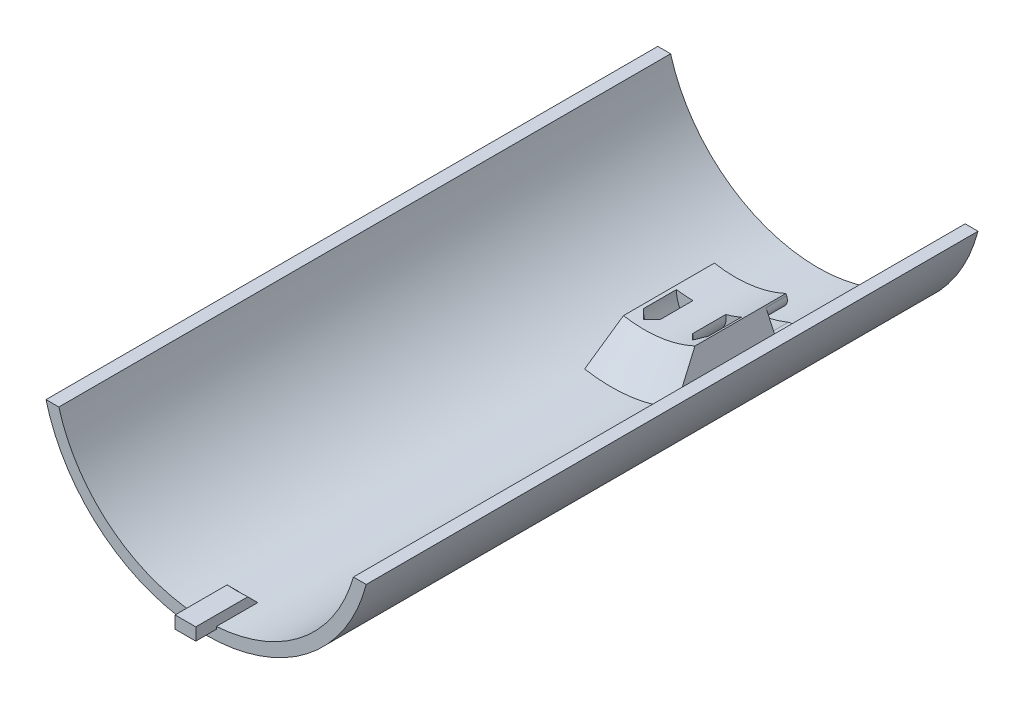
ISO-10303-21;
HEADER;
FILE_DESCRIPTION(('STEP AP214'),'2;1');
FILE_NAME('part.step','',(''),(''),'','','');
FILE_SCHEMA(('AUTOMOTIVE_DESIGN { 1 0 10303 214 1 1 1 1 }'));
ENDSEC;
DATA;
#1=APPLICATION_CONTEXT('core data for automotive mechanical design processes');
#2=APPLICATION_PROTOCOL_DEFINITION('international standard','automotive_design',2000,#1);
#3=PRODUCT_CONTEXT('',#1,'mechanical');
#4=PRODUCT('Part','Part','',(#3));
#5=PRODUCT_RELATED_PRODUCT_CATEGORY('part','',(#4));
#6=PRODUCT_DEFINITION_FORMATION('','',#4);
#7=PRODUCT_DEFINITION_CONTEXT('part definition',#1,'design');
#8=PRODUCT_DEFINITION('design','',#6,#7);
#9=PRODUCT_DEFINITION_SHAPE('','',#8);
#10=(LENGTH_UNIT() NAMED_UNIT(*) SI_UNIT(.MILLI.,.METRE.));
#11=(NAMED_UNIT(*) PLANE_ANGLE_UNIT() SI_UNIT($,.RADIAN.));
#12=(NAMED_UNIT(*) SI_UNIT($,.STERADIAN.) SOLID_ANGLE_UNIT());
#13=UNCERTAINTY_MEASURE_WITH_UNIT(LENGTH_MEASURE(1.E-05),#10,'distance_accuracy_value','');
#14=(GEOMETRIC_REPRESENTATION_CONTEXT(3) GLOBAL_UNCERTAINTY_ASSIGNED_CONTEXT((#13)) GLOBAL_UNIT_ASSIGNED_CONTEXT((#10,
#11,#12)) REPRESENTATION_CONTEXT('',''));
#15=CARTESIAN_POINT('',(0.,0.,0.));
#16=DIRECTION('',(0.,0.,1.));
#17=DIRECTION('',(1.,0.,0.));
#18=AXIS2_PLACEMENT_3D('',#15,#16,#17);
#19=CARTESIAN_POINT('',(0.,0.,40.));
#20=DIRECTION('',(0.90630778703665,0.4226182617407,0.));
#21=DIRECTION('',(-0.4226182617407,0.90630778703665,0.));
#22=AXIS2_PLACEMENT_3D('',#19,#20,#21);
#23=PLANE('',#22);
#24=DIRECTION('',(0.4226182617407,-0.90630778703665,0.));
#25=VECTOR('',#24,1.);
#26=CARTESIAN_POINT('',(0.,0.,20.));
#27=LINE('',#26,#25);
#28=CARTESIAN_POINT('',(15.4023919803688,-33.0305361943017,20.));
#29=VERTEX_POINT('',#28);
#30=CARTESIAN_POINT('',(15.6368756844059,-33.533388120356,20.));
#31=VERTEX_POINT('',#30);
#32=EDGE_CURVE('E258',#29,#31,#27,.T.);
#33=ORIENTED_EDGE('',*,*,#32,.F.);
#34=DIRECTION('',(0.,0.,-1.));
#35=VECTOR('',#34,1.);
#36=CARTESIAN_POINT('',(15.4023919803688,-33.0305361943017,40.));
#37=LINE('',#36,#35);
#38=CARTESIAN_POINT('',(15.4023919803688,-33.0305361943017,25.));
#39=VERTEX_POINT('',#38);
#40=EDGE_CURVE('E693',#29,#39,#37,.F.);
#41=ORIENTED_EDGE('',*,*,#40,.T.);
#42=DIRECTION('',(0.4226182617407,-0.90630778703665,0.));
#43=VECTOR('',#42,1.);
#44=CARTESIAN_POINT('',(0.,0.,25.));
#45=LINE('',#44,#43);
#46=CARTESIAN_POINT('',(12.4385536359546,-26.6745643534338,25.));
#47=VERTEX_POINT('',#46);
#48=EDGE_CURVE('E246',#47,#39,#45,.T.);
#49=ORIENTED_EDGE('',*,*,#48,.F.);
#50=DIRECTION('',(0.,0.,1.));
#51=VECTOR('',#50,1.);
#52=CARTESIAN_POINT('',(12.4385536359546,-26.6745643534338,20.));
#53=LINE('',#52,#51);
#54=CARTESIAN_POINT('',(12.4385536359546,-26.6745643534338,20.));
#55=VERTEX_POINT('',#54);
#56=EDGE_CURVE('E696',#47,#55,#53,.F.);
#57=ORIENTED_EDGE('',*,*,#56,.T.);
#58=CARTESIAN_POINT('',(12.2559295904803,-26.2829258240628,20.));
#59=VERTEX_POINT('',#58);
#60=EDGE_CURVE('E261',#59,#55,#27,.T.);
#61=ORIENTED_EDGE('',*,*,#60,.F.);
#62=DIRECTION('',(0.,0.,-1.));
#63=VECTOR('',#62,1.);
#64=CARTESIAN_POINT('',(12.2559295904803,-26.2829258240628,40.));
#65=LINE('',#64,#63);
#66=CARTESIAN_POINT('',(12.2559295904803,-26.2829258240628,42.0000000000001));
#67=VERTEX_POINT('',#66);
#68=EDGE_CURVE('E274',#67,#59,#65,.T.);
#69=ORIENTED_EDGE('',*,*,#68,.F.);
#70=DIRECTION('',(-0.298836238730119,0.640856382055785,-0.707106781186551));
#71=VECTOR('',#70,1.);
#72=CARTESIAN_POINT('',(0.,0.,12.9999999999998));
#73=LINE('',#72,#71);
#74=CARTESIAN_POINT('',(15.6368756844059,-33.533388120356,50.0000000000002));
#75=VERTEX_POINT('',#74);
#76=EDGE_CURVE('E706',#67,#75,#73,.F.);
#77=ORIENTED_EDGE('',*,*,#76,.T.);
#78=DIRECTION('',(0.,0.,-1.));
#79=VECTOR('',#78,1.);
#80=CARTESIAN_POINT('',(15.6368756844059,-33.533388120356,40.));
#81=LINE('',#80,#79);
#82=EDGE_CURVE('E273',#75,#31,#81,.T.);
#83=ORIENTED_EDGE('',*,*,#82,.T.);
#84=EDGE_LOOP('',(#33,#41,#49,#57,#61,#69,#77,#83));
#85=FACE_BOUND('',#84,.T.);
#86=ADVANCED_FACE('F37',(#85),#23,.T.);
#87=CARTESIAN_POINT('',(0.,0.,20.));
#88=DIRECTION('',(0.,0.,-1.));
#89=DIRECTION('',(-1.,0.,0.));
#90=AXIS2_PLACEMENT_3D('',#87,#88,#89);
#91=PLANE('',#90);
#92=CARTESIAN_POINT('',(0.,0.,20.));
#93=DIRECTION('',(0.,0.,-1.));
#94=DIRECTION('',(-1.,0.,0.));
#95=AXIS2_PLACEMENT_3D('',#92,#93,#94);
#96=CIRCLE('',#95,34.5);
#97=CARTESIAN_POINT('',(0.,-34.5,20.));
#98=VERTEX_POINT('',#97);
#99=CARTESIAN_POINT('',(12.8451311237587,-32.019565993521,20.));
#100=VERTEX_POINT('',#99);
#101=EDGE_CURVE('E232',#98,#100,#96,.F.);
#102=ORIENTED_EDGE('',*,*,#101,.T.);
#103=CARTESIAN_POINT('',(13.5897764062955,-33.8757727177831,20.));
#104=DIRECTION('',(0.,0.,-1.));
#105=DIRECTION('',(-1.,0.,0.));
#106=AXIS2_PLACEMENT_3D('',#103,#104,#105);
#107=CIRCLE('',#106,2.);
#108=EDGE_CURVE('E699',#100,#29,#107,.T.);
#109=ORIENTED_EDGE('',*,*,#108,.T.);
#110=ORIENTED_EDGE('',*,*,#32,.T.);
#111=CARTESIAN_POINT('',(0.,0.,20.));
#112=DIRECTION('',(0.,0.,-1.));
#113=DIRECTION('',(-1.,0.,0.));
#114=AXIS2_PLACEMENT_3D('',#111,#112,#113);
#115=CIRCLE('',#114,37.);
#116=CARTESIAN_POINT('',(-6.42498257367619,-36.4378868614517,20.));
#117=VERTEX_POINT('',#116);
#118=EDGE_CURVE('E264',#31,#117,#115,.T.);
#119=ORIENTED_EDGE('',*,*,#118,.T.);
#120=DIRECTION('',(0.173648177666924,0.984807753012209,0.));
#121=VECTOR('',#120,1.);
#122=CARTESIAN_POINT('',(0.,0.,20.));
#123=LINE('',#122,#121);
#124=CARTESIAN_POINT('',(-5.03579715234079,-28.5594248373541,20.));
#125=VERTEX_POINT('',#124);
#126=EDGE_CURVE('E267',#117,#125,#123,.T.);
#127=ORIENTED_EDGE('',*,*,#126,.T.);
#128=CARTESIAN_POINT('',(0.,0.,20.));
#129=DIRECTION('',(0.,0.,-1.));
#130=DIRECTION('',(-1.,0.,0.));
#131=AXIS2_PLACEMENT_3D('',#128,#129,#130);
#132=CIRCLE('',#131,29.);
#133=EDGE_CURVE('E270',#59,#125,#132,.T.);
#134=ORIENTED_EDGE('',*,*,#133,.F.);
#135=ORIENTED_EDGE('',*,*,#60,.T.);
#136=CARTESIAN_POINT('',(10.6259380618813,-27.5198008769152,20.));
#137=DIRECTION('',(0.,0.,-1.));
#138=DIRECTION('',(-1.,0.,0.));
#139=AXIS2_PLACEMENT_3D('',#136,#137,#138);
#140=CIRCLE('',#139,2.);
#141=CARTESIAN_POINT('',(11.3463406423478,-29.3855500889095,20.));
#142=VERTEX_POINT('',#141);
#143=EDGE_CURVE('E701',#55,#142,#140,.T.);
#144=ORIENTED_EDGE('',*,*,#143,.T.);
#145=CARTESIAN_POINT('',(0.,0.,20.));
#146=DIRECTION('',(0.,0.,-1.));
#147=DIRECTION('',(-1.,0.,0.));
#148=AXIS2_PLACEMENT_3D('',#145,#146,#147);
#149=CIRCLE('',#148,31.5);
#150=CARTESIAN_POINT('',(0.,-31.5,20.));
#151=VERTEX_POINT('',#150);
#152=EDGE_CURVE('E240',#151,#142,#149,.F.);
#153=ORIENTED_EDGE('',*,*,#152,.F.);
#154=CARTESIAN_POINT('',(0.,-33.,20.));
#155=DIRECTION('',(0.,0.,-1.));
#156=DIRECTION('',(-1.,0.,0.));
#157=AXIS2_PLACEMENT_3D('',#154,#155,#156);
#158=CIRCLE('',#157,1.5);
#159=EDGE_CURVE('E251',#98,#151,#158,.T.);
#160=ORIENTED_EDGE('',*,*,#159,.F.);
#161=EDGE_LOOP('',(#102,#109,#110,#119,#127,#134,#135,#144,#153,#160));
#162=FACE_BOUND('',#161,.T.);
#163=ADVANCED_FACE('F421',(#162),#91,.T.);
#164=CARTESIAN_POINT('',(0.,0.,148.));
#165=DIRECTION('',(0.,0.,-1.));
#166=DIRECTION('',(-1.,0.,0.));
#167=AXIS2_PLACEMENT_3D('',#164,#165,#166);
#168=CYLINDRICAL_SURFACE('',#167,37.);
#169=CARTESIAN_POINT('',(0.,0.,138.));
#170=DIRECTION('',(0.,0.,1.));
#171=DIRECTION('',(1.,0.,0.));
#172=AXIS2_PLACEMENT_3D('',#169,#170,#171);
#173=CIRCLE('',#172,37.);
#174=CARTESIAN_POINT('',(-2.5,-36.9154439225644,138.));
#175=VERTEX_POINT('',#174);
#176=CARTESIAN_POINT('',(2.5,-36.9154439225644,138.));
#177=VERTEX_POINT('',#176);
#178=EDGE_CURVE('E344',#175,#177,#173,.T.);
#179=ORIENTED_EDGE('',*,*,#178,.T.);
#180=DIRECTION('',(0.,0.,-1.));
#181=VECTOR('',#180,1.);
#182=CARTESIAN_POINT('',(2.5,-36.9154439225644,138.));
#183=LINE('',#182,#181);
#184=CARTESIAN_POINT('',(2.5,-36.9154439225644,148.));
#185=VERTEX_POINT('',#184);
#186=EDGE_CURVE('E347',#177,#185,#183,.F.);
#187=ORIENTED_EDGE('',*,*,#186,.T.);
#188=CARTESIAN_POINT('',(0.,0.,148.));
#189=DIRECTION('',(0.,0.,1.));
#190=DIRECTION('',(1.,0.,0.));
#191=AXIS2_PLACEMENT_3D('',#188,#189,#190);
#192=CIRCLE('',#191,37.);
#193=CARTESIAN_POINT('',(35.6230262611138,-10.,148.));
#194=VERTEX_POINT('',#193);
#195=EDGE_CURVE('E315',#185,#194,#192,.T.);
#196=ORIENTED_EDGE('',*,*,#195,.T.);
#197=DIRECTION('',(0.,0.,-1.));
#198=VECTOR('',#197,1.);
#199=CARTESIAN_POINT('',(35.6230262611138,-10.,148.));
#200=LINE('',#199,#198);
#201=CARTESIAN_POINT('',(35.6230262611138,-10.,0.));
#202=VERTEX_POINT('',#201);
#203=EDGE_CURVE('E322',#194,#202,#200,.T.);
#204=ORIENTED_EDGE('',*,*,#203,.T.);
#205=CARTESIAN_POINT('',(0.,0.,0.));
#206=DIRECTION('',(0.,0.,1.));
#207=DIRECTION('',(1.,0.,0.));
#208=AXIS2_PLACEMENT_3D('',#205,#206,#207);
#209=CIRCLE('',#208,37.);
#210=CARTESIAN_POINT('',(-35.6230262611138,-10.,0.));
#211=VERTEX_POINT('',#210);
#212=EDGE_CURVE('E310',#211,#202,#209,.T.);
#213=ORIENTED_EDGE('',*,*,#212,.F.);
#214=DIRECTION('',(0.,0.,-1.));
#215=VECTOR('',#214,1.);
#216=CARTESIAN_POINT('',(-35.6230262611138,-10.,148.));
#217=LINE('',#216,#215);
#218=CARTESIAN_POINT('',(-35.6230262611138,-10.,148.));
#219=VERTEX_POINT('',#218);
#220=EDGE_CURVE('E339',#219,#211,#217,.T.);
#221=ORIENTED_EDGE('',*,*,#220,.F.);
#222=CARTESIAN_POINT('',(-2.5,-36.9154439225644,148.));
#223=VERTEX_POINT('',#222);
#224=EDGE_CURVE('E311',#219,#223,#192,.T.);
#225=ORIENTED_EDGE('',*,*,#224,.T.);
#226=DIRECTION('',(0.,0.,-1.));
#227=VECTOR('',#226,1.);
#228=CARTESIAN_POINT('',(-2.5,-36.9154439225644,148.));
#229=LINE('',#228,#227);
#230=EDGE_CURVE('E341',#223,#175,#229,.T.);
#231=ORIENTED_EDGE('',*,*,#230,.T.);
#232=EDGE_LOOP('',(#179,#187,#196,#204,#213,#221,#225,#231));
#233=FACE_BOUND('',#232,.T.);
#234=CARTESIAN_POINT('',(0.,0.,50.0000000000002));
#235=DIRECTION('',(0.,0.,-1.));
#236=DIRECTION('',(-1.,0.,0.));
#237=AXIS2_PLACEMENT_3D('',#234,#235,#236);
#238=CIRCLE('',#237,37.);
#239=CARTESIAN_POINT('',(-6.42498257367619,-36.4378868614517,50.0000000000002));
#240=VERTEX_POINT('',#239);
#241=EDGE_CURVE('E392',#75,#240,#238,.T.);
#242=ORIENTED_EDGE('',*,*,#241,.T.);
#243=DIRECTION('',(0.,0.,-1.));
#244=VECTOR('',#243,1.);
#245=CARTESIAN_POINT('',(-6.42498257367619,-36.4378868614517,40.));
#246=LINE('',#245,#244);
#247=EDGE_CURVE('E279',#240,#117,#246,.T.);
#248=ORIENTED_EDGE('',*,*,#247,.T.);
#249=ORIENTED_EDGE('',*,*,#118,.F.);
#250=ORIENTED_EDGE('',*,*,#82,.F.);
#251=EDGE_LOOP('',(#242,#248,#249,#250));
#252=FACE_BOUND('',#251,.T.);
#253=ADVANCED_FACE('F379',(#233,#252),#168,.F.);
#254=CARTESIAN_POINT('',(0.,0.,148.));
#255=DIRECTION('',(0.,0.,1.));
#256=DIRECTION('',(1.,0.,0.));
#257=AXIS2_PLACEMENT_3D('',#254,#255,#256);
#258=PLANE('',#257);
#259=DIRECTION('',(-1.,0.,0.));
#260=VECTOR('',#259,1.);
#261=CARTESIAN_POINT('',(0.,-37.5,148.));
#262=LINE('',#261,#260);
#263=CARTESIAN_POINT('',(2.5,-37.5,148.));
#264=VERTEX_POINT('',#263);
#265=CARTESIAN_POINT('',(-2.5,-37.5,148.));
#266=VERTEX_POINT('',#265);
#267=EDGE_CURVE('E297',#264,#266,#262,.T.);
#268=ORIENTED_EDGE('',*,*,#267,.T.);
#269=DIRECTION('',(0.,1.,0.));
#270=VECTOR('',#269,1.);
#271=CARTESIAN_POINT('',(-2.5,0.,148.));
#272=LINE('',#271,#270);
#273=EDGE_CURVE('E276',#266,#223,#272,.T.);
#274=ORIENTED_EDGE('',*,*,#273,.T.);
#275=ORIENTED_EDGE('',*,*,#224,.F.);
#276=DIRECTION('',(-1.,0.,0.));
#277=VECTOR('',#276,1.);
#278=CARTESIAN_POINT('',(0.,-10.,148.));
#279=LINE('',#278,#277);
#280=CARTESIAN_POINT('',(-38.7298334620742,-10.,148.));
#281=VERTEX_POINT('',#280);
#282=EDGE_CURVE('E314',#219,#281,#279,.T.);
#283=ORIENTED_EDGE('',*,*,#282,.T.);
#284=CARTESIAN_POINT('',(0.,0.,148.));
#285=DIRECTION('',(0.,0.,1.));
#286=DIRECTION('',(1.,0.,0.));
#287=AXIS2_PLACEMENT_3D('',#284,#285,#286);
#288=CIRCLE('',#287,40.);
#289=CARTESIAN_POINT('',(38.7298334620742,-10.,148.));
#290=VERTEX_POINT('',#289);
#291=EDGE_CURVE('E317',#281,#290,#288,.T.);
#292=ORIENTED_EDGE('',*,*,#291,.T.);
#293=DIRECTION('',(-1.,0.,0.));
#294=VECTOR('',#293,1.);
#295=CARTESIAN_POINT('',(0.,-10.,148.));
#296=LINE('',#295,#294);
#297=EDGE_CURVE('E319',#290,#194,#296,.T.);
#298=ORIENTED_EDGE('',*,*,#297,.T.);
#299=ORIENTED_EDGE('',*,*,#195,.F.);
#300=DIRECTION('',(0.,1.,0.));
#301=VECTOR('',#300,1.);
#302=CARTESIAN_POINT('',(2.5,0.,148.));
#303=LINE('',#302,#301);
#304=EDGE_CURVE('E287',#264,#185,#303,.T.);
#305=ORIENTED_EDGE('',*,*,#304,.F.);
#306=EDGE_LOOP('',(#268,#274,#275,#283,#292,#298,#299,#305));
#307=FACE_BOUND('',#306,.T.);
#308=ADVANCED_FACE('F401',(#307),#258,.T.);
#309=CARTESIAN_POINT('',(0.,-10.,148.));
#310=DIRECTION('',(0.,-1.,0.));
#311=DIRECTION('',(0.,0.,-1.));
#312=AXIS2_PLACEMENT_3D('',#309,#310,#311);
#313=PLANE('',#312);
#314=DIRECTION('',(-1.,0.,0.));
#315=VECTOR('',#314,1.);
#316=CARTESIAN_POINT('',(0.,-10.,0.));
#317=LINE('',#316,#315);
#318=CARTESIAN_POINT('',(-38.7298334620742,-10.,0.));
#319=VERTEX_POINT('',#318);
#320=EDGE_CURVE('E325',#211,#319,#317,.T.);
#321=ORIENTED_EDGE('',*,*,#320,.T.);
#322=DIRECTION('',(0.,0.,-1.));
#323=VECTOR('',#322,1.);
#324=CARTESIAN_POINT('',(-38.7298334620742,-10.,148.));
#325=LINE('',#324,#323);
#326=EDGE_CURVE('E336',#281,#319,#325,.T.);
#327=ORIENTED_EDGE('',*,*,#326,.F.);
#328=ORIENTED_EDGE('',*,*,#282,.F.);
#329=ORIENTED_EDGE('',*,*,#220,.T.);
#330=EDGE_LOOP('',(#321,#327,#328,#329));
#331=FACE_BOUND('',#330,.T.);
#332=ADVANCED_FACE('F404',(#331),#313,.F.);
#333=CARTESIAN_POINT('',(0.,0.,148.));
#334=DIRECTION('',(0.,0.,-1.));
#335=DIRECTION('',(-1.,0.,0.));
#336=AXIS2_PLACEMENT_3D('',#333,#334,#335);
#337=CYLINDRICAL_SURFACE('',#336,40.);
#338=CARTESIAN_POINT('',(0.,0.,0.));
#339=DIRECTION('',(0.,0.,1.));
#340=DIRECTION('',(1.,0.,0.));
#341=AXIS2_PLACEMENT_3D('',#338,#339,#340);
#342=CIRCLE('',#341,40.);
#343=CARTESIAN_POINT('',(38.7298334620742,-10.,0.));
#344=VERTEX_POINT('',#343);
#345=EDGE_CURVE('E327',#319,#344,#342,.T.);
#346=ORIENTED_EDGE('',*,*,#345,.T.);
#347=DIRECTION('',(0.,0.,-1.));
#348=VECTOR('',#347,1.);
#349=CARTESIAN_POINT('',(38.7298334620742,-10.,148.));
#350=LINE('',#349,#348);
#351=EDGE_CURVE('E333',#290,#344,#350,.T.);
#352=ORIENTED_EDGE('',*,*,#351,.F.);
#353=ORIENTED_EDGE('',*,*,#291,.F.);
#354=ORIENTED_EDGE('',*,*,#326,.T.);
#355=EDGE_LOOP('',(#346,#352,#353,#354));
#356=FACE_BOUND('',#355,.T.);
#357=ADVANCED_FACE('F412',(#356),#337,.T.);
#358=CARTESIAN_POINT('',(0.,-10.,148.));
#359=DIRECTION('',(0.,-1.,0.));
#360=DIRECTION('',(0.,0.,-1.));
#361=AXIS2_PLACEMENT_3D('',#358,#359,#360);
#362=PLANE('',#361);
#363=DIRECTION('',(-1.,0.,0.));
#364=VECTOR('',#363,1.);
#365=CARTESIAN_POINT('',(0.,-10.,0.));
#366=LINE('',#365,#364);
#367=EDGE_CURVE('E329',#344,#202,#366,.T.);
#368=ORIENTED_EDGE('',*,*,#367,.T.);
#369=ORIENTED_EDGE('',*,*,#203,.F.);
#370=ORIENTED_EDGE('',*,*,#297,.F.);
#371=ORIENTED_EDGE('',*,*,#351,.T.);
#372=EDGE_LOOP('',(#368,#369,#370,#371));
#373=FACE_BOUND('',#372,.T.);
#374=ADVANCED_FACE('F408',(#373),#362,.F.);
#375=CARTESIAN_POINT('',(0.,0.,0.));
#376=DIRECTION('',(0.,0.,1.));
#377=DIRECTION('',(1.,0.,0.));
#378=AXIS2_PLACEMENT_3D('',#375,#376,#377);
#379=PLANE('',#378);
#380=ORIENTED_EDGE('',*,*,#212,.T.);
#381=ORIENTED_EDGE('',*,*,#367,.F.);
#382=ORIENTED_EDGE('',*,*,#345,.F.);
#383=ORIENTED_EDGE('',*,*,#320,.F.);
#384=EDGE_LOOP('',(#380,#381,#382,#383));
#385=FACE_BOUND('',#384,.T.);
#386=ADVANCED_FACE('F399',(#385),#379,.F.);
#387=CARTESIAN_POINT('',(-2.5,0.,153.));
#388=DIRECTION('',(-1.,0.,0.));
#389=DIRECTION('',(0.,0.,1.));
#390=AXIS2_PLACEMENT_3D('',#387,#388,#389);
#391=PLANE('',#390);
#392=ORIENTED_EDGE('',*,*,#273,.F.);
#393=DIRECTION('',(0.,0.,-1.));
#394=VECTOR('',#393,1.);
#395=CARTESIAN_POINT('',(-2.5,-37.5,153.));
#396=LINE('',#395,#394);
#397=CARTESIAN_POINT('',(-2.5,-37.5,153.));
#398=VERTEX_POINT('',#397);
#399=EDGE_CURVE('E307',#398,#266,#396,.T.);
#400=ORIENTED_EDGE('',*,*,#399,.F.);
#401=DIRECTION('',(0.,1.,0.));
#402=VECTOR('',#401,1.);
#403=CARTESIAN_POINT('',(-2.5,0.,153.));
#404=LINE('',#403,#402);
#405=CARTESIAN_POINT('',(-2.5,-34.5,153.));
#406=VERTEX_POINT('',#405);
#407=EDGE_CURVE('E283',#398,#406,#404,.T.);
#408=ORIENTED_EDGE('',*,*,#407,.T.);
#409=DIRECTION('',(0.,0.,-1.));
#410=VECTOR('',#409,1.);
#411=CARTESIAN_POINT('',(-2.5,-34.5,153.));
#412=LINE('',#411,#410);
#413=CARTESIAN_POINT('',(-2.5,-34.5,140.409538887144));
#414=VERTEX_POINT('',#413);
#415=EDGE_CURVE('E294',#406,#414,#412,.T.);
#416=ORIENTED_EDGE('',*,*,#415,.T.);
#417=CARTESIAN_POINT('',(-2.5,-34.5,140.409538887144));
#418=CARTESIAN_POINT('',(-2.5,-34.9026071521608,140.007982318918));
#419=CARTESIAN_POINT('',(-2.5,-35.3051977217997,139.606409127531));
#420=CARTESIAN_POINT('',(-2.5,-36.1103456959879,138.803229498483));
#421=CARTESIAN_POINT('',(-2.5,-36.512903100537,138.401623060822));
#422=CARTESIAN_POINT('',(-2.5,-36.9154439225644,138.));
#423=B_SPLINE_CURVE_WITH_KNOTS('',3,(#417,#418,#419,#420,#421,#422),.UNSPECIFIED.,.F.,.F.,(4,2,
4),(0.,1.70589031101767,3.41178062183955),.UNSPECIFIED.);
#424=EDGE_CURVE('E385',#414,#175,#423,.T.);
#425=ORIENTED_EDGE('',*,*,#424,.T.);
#426=ORIENTED_EDGE('',*,*,#230,.F.);
#427=EDGE_LOOP('',(#392,#400,#408,#416,#425,#426));
#428=FACE_BOUND('',#427,.T.);
#429=ADVANCED_FACE('F394',(#428),#391,.T.);
#430=CARTESIAN_POINT('',(0.,-37.5,153.));
#431=DIRECTION('',(0.,-1.,0.));
#432=DIRECTION('',(0.,0.,-1.));
#433=AXIS2_PLACEMENT_3D('',#430,#431,#432);
#434=PLANE('',#433);
#435=ORIENTED_EDGE('',*,*,#267,.F.);
#436=DIRECTION('',(0.,0.,-1.));
#437=VECTOR('',#436,1.);
#438=CARTESIAN_POINT('',(2.5,-37.5,153.));
#439=LINE('',#438,#437);
#440=CARTESIAN_POINT('',(2.5,-37.5,153.));
#441=VERTEX_POINT('',#440);
#442=EDGE_CURVE('E305',#441,#264,#439,.T.);
#443=ORIENTED_EDGE('',*,*,#442,.F.);
#444=DIRECTION('',(-1.,0.,0.));
#445=VECTOR('',#444,1.);
#446=CARTESIAN_POINT('',(0.,-37.5,153.));
#447=LINE('',#446,#445);
#448=EDGE_CURVE('E286',#441,#398,#447,.T.);
#449=ORIENTED_EDGE('',*,*,#448,.T.);
#450=ORIENTED_EDGE('',*,*,#399,.T.);
#451=EDGE_LOOP('',(#435,#443,#449,#450));
#452=FACE_BOUND('',#451,.T.);
#453=ADVANCED_FACE('F398',(#452),#434,.T.);
#454=CARTESIAN_POINT('',(2.5,0.,153.));
#455=DIRECTION('',(-1.,0.,0.));
#456=DIRECTION('',(0.,0.,1.));
#457=AXIS2_PLACEMENT_3D('',#454,#455,#456);
#458=PLANE('',#457);
#459=ORIENTED_EDGE('',*,*,#304,.T.);
#460=ORIENTED_EDGE('',*,*,#186,.F.);
#461=CARTESIAN_POINT('',(2.5,-36.9154439225644,138.));
#462=CARTESIAN_POINT('',(2.5,-36.512903100537,138.401623060822));
#463=CARTESIAN_POINT('',(2.5,-36.1103456959879,138.803229498483));
#464=CARTESIAN_POINT('',(2.5,-35.3051977217997,139.606409127531));
#465=CARTESIAN_POINT('',(2.5,-34.9026071521608,140.007982318918));
#466=CARTESIAN_POINT('',(2.5,-34.5,140.409538887144));
#467=B_SPLINE_CURVE_WITH_KNOTS('',3,(#461,#462,#463,#464,#465,#466),.UNSPECIFIED.,.F.,.F.,(4,2,
4),(0.,1.70589031082187,3.41178062183954),.UNSPECIFIED.);
#468=CARTESIAN_POINT('',(2.5,-34.5,140.409538887144));
#469=VERTEX_POINT('',#468);
#470=EDGE_CURVE('E349',#177,#469,#467,.T.);
#471=ORIENTED_EDGE('',*,*,#470,.T.);
#472=DIRECTION('',(0.,0.,-1.));
#473=VECTOR('',#472,1.);
#474=CARTESIAN_POINT('',(2.5,-34.5,153.));
#475=LINE('',#474,#473);
#476=CARTESIAN_POINT('',(2.5,-34.5,153.));
#477=VERTEX_POINT('',#476);
#478=EDGE_CURVE('E303',#477,#469,#475,.T.);
#479=ORIENTED_EDGE('',*,*,#478,.F.);
#480=DIRECTION('',(0.,1.,0.));
#481=VECTOR('',#480,1.);
#482=CARTESIAN_POINT('',(2.5,0.,153.));
#483=LINE('',#482,#481);
#484=EDGE_CURVE('E290',#441,#477,#483,.T.);
#485=ORIENTED_EDGE('',*,*,#484,.F.);
#486=ORIENTED_EDGE('',*,*,#442,.T.);
#487=EDGE_LOOP('',(#459,#460,#471,#479,#485,#486));
#488=FACE_BOUND('',#487,.T.);
#489=ADVANCED_FACE('F365',(#488),#458,.F.);
#490=CARTESIAN_POINT('',(0.,-34.5,153.));
#491=DIRECTION('',(0.,-1.,0.));
#492=DIRECTION('',(0.,0.,-1.));
#493=AXIS2_PLACEMENT_3D('',#490,#491,#492);
#494=PLANE('',#493);
#495=ORIENTED_EDGE('',*,*,#478,.T.);
#496=CARTESIAN_POINT('',(2.5,-34.5,140.409538887144));
#497=CARTESIAN_POINT('',(1.66666666666667,-34.5,140.469846295715));
#498=CARTESIAN_POINT('',(0.833333333333333,-34.5,140.5));
#499=CARTESIAN_POINT('',(-0.833333333333334,-34.5,140.5));
#500=CARTESIAN_POINT('',(-1.66666666666667,-34.5,140.469846295715));
#501=CARTESIAN_POINT('',(-2.5,-34.5,140.409538887144));
#502=B_SPLINE_CURVE_WITH_KNOTS('',3,(#496,#497,#498,#499,#500,#501),.UNSPECIFIED.,.F.,.F.,(4,2,
4),(0.,2.50163610721846,5.00327221443692),.UNSPECIFIED.);
#503=EDGE_CURVE('E358',#469,#414,#502,.T.);
#504=ORIENTED_EDGE('',*,*,#503,.T.);
#505=ORIENTED_EDGE('',*,*,#415,.F.);
#506=DIRECTION('',(-1.,0.,0.));
#507=VECTOR('',#506,1.);
#508=CARTESIAN_POINT('',(0.,-34.5,153.));
#509=LINE('',#508,#507);
#510=EDGE_CURVE('E292',#477,#406,#509,.T.);
#511=ORIENTED_EDGE('',*,*,#510,.F.);
#512=EDGE_LOOP('',(#495,#504,#505,#511));
#513=FACE_BOUND('',#512,.T.);
#514=ADVANCED_FACE('F435',(#513),#494,.F.);
#515=CARTESIAN_POINT('',(0.,0.,153.));
#516=DIRECTION('',(0.,0.,1.));
#517=DIRECTION('',(1.,0.,0.));
#518=AXIS2_PLACEMENT_3D('',#515,#516,#517);
#519=PLANE('',#518);
#520=ORIENTED_EDGE('',*,*,#407,.F.);
#521=ORIENTED_EDGE('',*,*,#448,.F.);
#522=ORIENTED_EDGE('',*,*,#484,.T.);
#523=ORIENTED_EDGE('',*,*,#510,.T.);
#524=EDGE_LOOP('',(#520,#521,#522,#523));
#525=FACE_BOUND('',#524,.T.);
#526=ADVANCED_FACE('F377',(#525),#519,.T.);
#527=CARTESIAN_POINT('',(0.,0.,138.));
#528=DIRECTION('',(0.,0.,-1.));
#529=DIRECTION('',(-1.,0.,0.));
#530=AXIS2_PLACEMENT_3D('',#527,#528,#529);
#531=CONICAL_SURFACE('',#530,37.,0.785398163397454);
#532=ORIENTED_EDGE('',*,*,#424,.F.);
#533=ORIENTED_EDGE('',*,*,#503,.F.);
#534=ORIENTED_EDGE('',*,*,#470,.F.);
#535=ORIENTED_EDGE('',*,*,#178,.F.);
#536=EDGE_LOOP('',(#532,#533,#534,#535));
#537=FACE_BOUND('',#536,.T.);
#538=ADVANCED_FACE('F369',(#537),#531,.F.);
#539=CARTESIAN_POINT('',(0.,0.,40.));
#540=DIRECTION('',(0.,0.,-1.));
#541=DIRECTION('',(-1.,0.,0.));
#542=AXIS2_PLACEMENT_3D('',#539,#540,#541);
#543=CYLINDRICAL_SURFACE('',#542,29.);
#544=DIRECTION('',(0.,0.,1.));
#545=VECTOR('',#544,1.);
#546=CARTESIAN_POINT('',(-4.2145170746199,-28.6921216682862,35.));
#547=LINE('',#546,#545);
#548=CARTESIAN_POINT('',(-4.2145170746199,-28.6921216682862,30.));
#549=VERTEX_POINT('',#548);
#550=CARTESIAN_POINT('',(-4.2145170746199,-28.6921216682862,38.));
#551=VERTEX_POINT('',#550);
#552=EDGE_CURVE('E678',#549,#551,#547,.T.);
#553=ORIENTED_EDGE('',*,*,#552,.F.);
#554=CARTESIAN_POINT('',(0.,0.,30.));
#555=DIRECTION('',(0.,0.,-1.));
#556=DIRECTION('',(-1.,0.,0.));
#557=AXIS2_PLACEMENT_3D('',#554,#555,#556);
#558=CIRCLE('',#557,29.);
#559=CARTESIAN_POINT('',(-0.207084751142569,-28.9992606096404,30.));
#560=VERTEX_POINT('',#559);
#561=EDGE_CURVE('E229',#549,#560,#558,.F.);
#562=ORIENTED_EDGE('',*,*,#561,.T.);
#563=DIRECTION('',(0.,0.,1.));
#564=VECTOR('',#563,1.);
#565=CARTESIAN_POINT('',(-0.207084751142569,-28.9992606096404,35.));
#566=LINE('',#565,#564);
#567=CARTESIAN_POINT('',(-0.207084751142569,-28.9992606096404,37.9999999999999));
#568=VERTEX_POINT('',#567);
#569=EDGE_CURVE('E227',#560,#568,#566,.T.);
#570=ORIENTED_EDGE('',*,*,#569,.T.);
#571=CARTESIAN_POINT('',(-0.207084751142569,-28.9992606096404,37.9999999999999));
#572=CARTESIAN_POINT('',(-0.374274583715675,-28.9980667730931,38.1667960230475));
#573=CARTESIAN_POINT('',(-0.541479046597942,-28.9954267614297,38.3335670654372));
#574=CARTESIAN_POINT('',(-0.8758482169748,-28.9872532683173,38.6670277670012));
#575=CARTESIAN_POINT('',(-1.0430129266661,-28.9817202221919,38.8337174346441));
#576=CARTESIAN_POINT('',(-1.37728392050183,-28.9677591816172,39.167034169548));
#577=CARTESIAN_POINT('',(-1.54439020463968,-28.9593311868419,39.333661236802));
#578=CARTESIAN_POINT('',(-1.87852549385907,-28.9395776813314,39.6668714416682));
#579=CARTESIAN_POINT('',(-2.04555448353119,-28.9282517348488,39.8334545688995));
#580=CARTESIAN_POINT('',(-2.21251025716778,-28.9154767963789,40.));
#581=B_SPLINE_CURVE_WITH_KNOTS('',3,(#571,#572,#573,#574,#575,#576,#577,#578,#579,#580),
.UNSPECIFIED.,.F.,.F.,(4,2,2,2,4),(0.,0.708496142273165,1.41688570566948,2.12527534881712,
2.83377157087118),.UNSPECIFIED.);
#582=CARTESIAN_POINT('',(-2.21251025716778,-28.9154767963789,40.));
#583=VERTEX_POINT('',#582);
#584=EDGE_CURVE('E61',#568,#583,#581,.T.);
#585=ORIENTED_EDGE('',*,*,#584,.T.);
#586=CARTESIAN_POINT('',(-2.21251025716773,-28.9154767963789,40.));
#587=CARTESIAN_POINT('',(-2.37976930691551,-28.9026787969477,39.833152019275));
#588=CARTESIAN_POINT('',(-2.54695487518996,-28.8884265343288,39.6663418710062));
#589=CARTESIAN_POINT('',(-2.88110916794864,-28.8570158897078,39.332829112705));
#590=CARTESIAN_POINT('',(-3.04807792156375,-28.839857950349,39.1661264901694));
#591=CARTESIAN_POINT('',(-3.38177967252148,-28.802634460374,38.8328098365629));
#592=CARTESIAN_POINT('',(-3.54851266982528,-28.7825689092793,38.6661958055067));
#593=CARTESIAN_POINT('',(-3.88172366975261,-28.7395276097291,38.3330375503571));
#594=CARTESIAN_POINT('',(-4.04820162969633,-28.7165514187373,38.1664933407508));
#595=CARTESIAN_POINT('',(-4.2145170746199,-28.6921216682862,38.));
#596=B_SPLINE_CURVE_WITH_KNOTS('',3,(#586,#587,#588,#589,#590,#591,#592,#593,#594,#595),
.UNSPECIFIED.,.F.,.F.,(4,2,2,2,4),(0.,0.70978331808964,1.41945860675403,2.12913401222618,
2.83891744716707),.UNSPECIFIED.);
#597=EDGE_CURVE('E48',#583,#551,#596,.T.);
#598=ORIENTED_EDGE('',*,*,#597,.T.);
#599=EDGE_LOOP('',(#553,#562,#570,#585,#598));
#600=FACE_BOUND('',#599,.T.);
#601=DIRECTION('',(0.,0.,1.));
#602=VECTOR('',#601,1.);
#603=CARTESIAN_POINT('',(11.496978419863,-26.6236640456043,35.));
#604=LINE('',#603,#602);
#605=CARTESIAN_POINT('',(11.496978419863,-26.6236640456043,38.));
#606=VERTEX_POINT('',#605);
#607=CARTESIAN_POINT('',(11.496978419863,-26.6236640456043,30.));
#608=VERTEX_POINT('',#607);
#609=EDGE_CURVE('E216',#606,#608,#604,.F.);
#610=ORIENTED_EDGE('',*,*,#609,.F.);
#611=CARTESIAN_POINT('',(11.496978419863,-26.6236640456043,38.));
#612=CARTESIAN_POINT('',(11.3426529209845,-26.6903069771358,38.1664933407508));
#613=CARTESIAN_POINT('',(11.1877942357795,-26.7555879400278,38.3330375503571));
#614=CARTESIAN_POINT('',(10.8770770333956,-26.8834039956792,38.6661958055067));
#615=CARTESIAN_POINT('',(10.7212186719791,-26.9459395048495,38.8328098365629));
#616=CARTESIAN_POINT('',(10.4085216805818,-27.0682630036929,39.1661264901694));
#617=CARTESIAN_POINT('',(10.2516830507625,-27.1280509938181,39.332829112705));
#618=CARTESIAN_POINT('',(9.93704446246838,-27.2448768416466,39.6663418710062));
#619=CARTESIAN_POINT('',(9.77924436129084,-27.301914279329,39.833152019275));
#620=CARTESIAN_POINT('',(9.62099689145091,-27.3575660250449,40.));
#621=B_SPLINE_CURVE_WITH_KNOTS('',3,(#611,#612,#613,#614,#615,#616,#617,#618,#619,#620),
.UNSPECIFIED.,.F.,.F.,(4,2,2,2,4),(0.,0.709783434940889,1.41945884041304,2.12913412907742,
2.83891744716707),.UNSPECIFIED.);
#622=CARTESIAN_POINT('',(9.62099689145096,-27.3575660250449,40.));
#623=VERTEX_POINT('',#622);
#624=EDGE_CURVE('E11',#606,#623,#621,.T.);
#625=ORIENTED_EDGE('',*,*,#624,.T.);
#626=CARTESIAN_POINT('',(9.62099689145096,-27.3575660250449,40.));
#627=CARTESIAN_POINT('',(9.46303639522333,-27.4131170019492,39.8334545688995));
#628=CARTESIAN_POINT('',(9.30463015101357,-27.4672873097753,39.6668714416682));
#629=CARTESIAN_POINT('',(8.98699282911564,-27.5728483073984,39.333661236802));
#630=CARTESIAN_POINT('',(8.82776187909155,-27.6242394141069,39.167034169548));
#631=CARTESIAN_POINT('',(8.5084942763565,-27.7242404431899,38.8337174346441));
#632=CARTESIAN_POINT('',(8.34845762373625,-27.7728503658776,38.6670277670012));
#633=CARTESIAN_POINT('',(8.02759726223689,-27.8672864633546,38.3335670654372));
#634=CARTESIAN_POINT('',(7.8667734385659,-27.913112218222,38.1667960230475));
#635=CARTESIAN_POINT('',(7.70558944902579,-27.9575372885929,37.9999999999999));
#636=B_SPLINE_CURVE_WITH_KNOTS('',3,(#626,#627,#628,#629,#630,#631,#632,#633,#634,#635),
.UNSPECIFIED.,.F.,.F.,(4,2,2,2,4),(0.,0.708496222054052,1.4168858652017,2.12527542859801,
2.83377157087118),.UNSPECIFIED.);
#637=CARTESIAN_POINT('',(7.70558944902579,-27.9575372885929,37.9999999999999));
#638=VERTEX_POINT('',#637);
#639=EDGE_CURVE('E211',#623,#638,#636,.T.);
#640=ORIENTED_EDGE('',*,*,#639,.T.);
#641=DIRECTION('',(0.,0.,1.));
#642=VECTOR('',#641,1.);
#643=CARTESIAN_POINT('',(7.70558944902579,-27.9575372885929,35.));
#644=LINE('',#643,#642);
#645=CARTESIAN_POINT('',(7.70558944902579,-27.9575372885929,30.));
#646=VERTEX_POINT('',#645);
#647=EDGE_CURVE('E205',#638,#646,#644,.F.);
#648=ORIENTED_EDGE('',*,*,#647,.T.);
#649=EDGE_CURVE('E209',#646,#608,#558,.F.);
#650=ORIENTED_EDGE('',*,*,#649,.T.);
#651=EDGE_LOOP('',(#610,#625,#640,#648,#650));
#652=FACE_BOUND('',#651,.T.);
#653=ORIENTED_EDGE('',*,*,#133,.T.);
#654=DIRECTION('',(0.,0.,-1.));
#655=VECTOR('',#654,1.);
#656=CARTESIAN_POINT('',(-5.03579715234079,-28.5594248373541,40.));
#657=LINE('',#656,#655);
#658=CARTESIAN_POINT('',(-5.03579715234079,-28.5594248373541,42.0000000000001));
#659=VERTEX_POINT('',#658);
#660=EDGE_CURVE('E277',#659,#125,#657,.T.);
#661=ORIENTED_EDGE('',*,*,#660,.F.);
#662=CARTESIAN_POINT('',(0.,0.,42.0000000000001));
#663=DIRECTION('',(0.,0.,1.));
#664=DIRECTION('',(1.,0.,0.));
#665=AXIS2_PLACEMENT_3D('',#662,#663,#664);
#666=CIRCLE('',#665,29.);
#667=EDGE_CURVE('E709',#659,#67,#666,.T.);
#668=ORIENTED_EDGE('',*,*,#667,.T.);
#669=ORIENTED_EDGE('',*,*,#68,.T.);
#670=EDGE_LOOP('',(#653,#661,#668,#669));
#671=FACE_BOUND('',#670,.T.);
#672=ADVANCED_FACE('F207',(#600,#652,#671),#543,.F.);
#673=CARTESIAN_POINT('',(0.,0.,40.));
#674=DIRECTION('',(-0.984807753012209,0.173648177666924,0.));
#675=DIRECTION('',(-0.173648177666924,-0.984807753012209,0.));
#676=AXIS2_PLACEMENT_3D('',#673,#674,#675);
#677=PLANE('',#676);
#678=ORIENTED_EDGE('',*,*,#126,.F.);
#679=ORIENTED_EDGE('',*,*,#247,.F.);
#680=DIRECTION('',(-0.122787803968968,-0.696364240320016,0.707106781186551));
#681=VECTOR('',#680,1.);
#682=CARTESIAN_POINT('',(0.,0.,12.9999999999998));
#683=LINE('',#682,#681);
#684=EDGE_CURVE('E711',#240,#659,#683,.F.);
#685=ORIENTED_EDGE('',*,*,#684,.T.);
#686=ORIENTED_EDGE('',*,*,#660,.T.);
#687=EDGE_LOOP('',(#678,#679,#685,#686));
#688=FACE_BOUND('',#687,.T.);
#689=ADVANCED_FACE('F432',(#688),#677,.T.);
#690=CARTESIAN_POINT('',(0.,0.,50.0000000000002));
#691=DIRECTION('',(0.,0.,1.));
#692=DIRECTION('',(1.,0.,0.));
#693=AXIS2_PLACEMENT_3D('',#690,#691,#692);
#694=CONICAL_SURFACE('',#693,37.,0.785398163397443);
#695=ORIENTED_EDGE('',*,*,#76,.F.);
#696=ORIENTED_EDGE('',*,*,#667,.F.);
#697=ORIENTED_EDGE('',*,*,#684,.F.);
#698=ORIENTED_EDGE('',*,*,#241,.F.);
#699=EDGE_LOOP('',(#695,#696,#697,#698));
#700=FACE_BOUND('',#699,.T.);
#701=ADVANCED_FACE('F381',(#700),#694,.F.);
#702=CARTESIAN_POINT('',(0.,0.,25.));
#703=DIRECTION('',(0.,0.,-1.));
#704=DIRECTION('',(-1.,0.,0.));
#705=AXIS2_PLACEMENT_3D('',#702,#703,#704);
#706=CYLINDRICAL_SURFACE('',#705,34.5);
#707=CARTESIAN_POINT('',(0.,0.,25.));
#708=DIRECTION('',(0.,0.,-1.));
#709=DIRECTION('',(-1.,0.,0.));
#710=AXIS2_PLACEMENT_3D('',#707,#708,#709);
#711=CIRCLE('',#710,34.5);
#712=CARTESIAN_POINT('',(0.,-34.5,25.));
#713=VERTEX_POINT('',#712);
#714=CARTESIAN_POINT('',(12.8451311237587,-32.019565993521,25.));
#715=VERTEX_POINT('',#714);
#716=EDGE_CURVE('E236',#713,#715,#711,.F.);
#717=ORIENTED_EDGE('',*,*,#716,.T.);
#718=DIRECTION('',(0.,0.,-1.));
#719=VECTOR('',#718,1.);
#720=CARTESIAN_POINT('',(12.8451311237587,-32.019565993521,25.));
#721=LINE('',#720,#719);
#722=EDGE_CURVE('E703',#715,#100,#721,.T.);
#723=ORIENTED_EDGE('',*,*,#722,.T.);
#724=ORIENTED_EDGE('',*,*,#101,.F.);
#725=DIRECTION('',(0.,0.,-1.));
#726=VECTOR('',#725,1.);
#727=CARTESIAN_POINT('',(0.,-34.5,25.));
#728=LINE('',#727,#726);
#729=EDGE_CURVE('E248',#713,#98,#728,.T.);
#730=ORIENTED_EDGE('',*,*,#729,.F.);
#731=EDGE_LOOP('',(#717,#723,#724,#730));
#732=FACE_BOUND('',#731,.T.);
#733=ADVANCED_FACE('F523',(#732),#706,.F.);
#734=CARTESIAN_POINT('',(0.,0.,25.));
#735=DIRECTION('',(0.,0.,-1.));
#736=DIRECTION('',(-1.,0.,0.));
#737=AXIS2_PLACEMENT_3D('',#734,#735,#736);
#738=CYLINDRICAL_SURFACE('',#737,31.5);
#739=ORIENTED_EDGE('',*,*,#152,.T.);
#740=DIRECTION('',(0.,0.,-1.));
#741=VECTOR('',#740,1.);
#742=CARTESIAN_POINT('',(11.3463406423478,-29.3855500889095,25.));
#743=LINE('',#742,#741);
#744=CARTESIAN_POINT('',(11.3463406423478,-29.3855500889095,25.));
#745=VERTEX_POINT('',#744);
#746=EDGE_CURVE('E691',#142,#745,#743,.F.);
#747=ORIENTED_EDGE('',*,*,#746,.T.);
#748=CARTESIAN_POINT('',(0.,0.,25.));
#749=DIRECTION('',(0.,0.,-1.));
#750=DIRECTION('',(-1.,0.,0.));
#751=AXIS2_PLACEMENT_3D('',#748,#749,#750);
#752=CIRCLE('',#751,31.5);
#753=CARTESIAN_POINT('',(0.,-31.5,25.));
#754=VERTEX_POINT('',#753);
#755=EDGE_CURVE('E243',#754,#745,#752,.F.);
#756=ORIENTED_EDGE('',*,*,#755,.F.);
#757=DIRECTION('',(0.,0.,-1.));
#758=VECTOR('',#757,1.);
#759=CARTESIAN_POINT('',(0.,-31.5,25.));
#760=LINE('',#759,#758);
#761=EDGE_CURVE('E256',#754,#151,#760,.T.);
#762=ORIENTED_EDGE('',*,*,#761,.T.);
#763=EDGE_LOOP('',(#739,#747,#756,#762));
#764=FACE_BOUND('',#763,.T.);
#765=ADVANCED_FACE('F535',(#764),#738,.T.);
#766=CARTESIAN_POINT('',(0.,-33.,25.));
#767=DIRECTION('',(0.,0.,-1.));
#768=DIRECTION('',(-1.,0.,0.));
#769=AXIS2_PLACEMENT_3D('',#766,#767,#768);
#770=CYLINDRICAL_SURFACE('',#769,1.5);
#771=ORIENTED_EDGE('',*,*,#159,.T.);
#772=ORIENTED_EDGE('',*,*,#761,.F.);
#773=CARTESIAN_POINT('',(0.,-33.,25.));
#774=DIRECTION('',(0.,0.,-1.));
#775=DIRECTION('',(-1.,0.,0.));
#776=AXIS2_PLACEMENT_3D('',#773,#774,#775);
#777=CIRCLE('',#776,1.5);
#778=EDGE_CURVE('E239',#713,#754,#777,.T.);
#779=ORIENTED_EDGE('',*,*,#778,.F.);
#780=ORIENTED_EDGE('',*,*,#729,.T.);
#781=EDGE_LOOP('',(#771,#772,#779,#780));
#782=FACE_BOUND('',#781,.T.);
#783=ADVANCED_FACE('F530',(#782),#770,.F.);
#784=CARTESIAN_POINT('',(0.,0.,25.));
#785=DIRECTION('',(0.,0.,-1.));
#786=DIRECTION('',(-1.,0.,0.));
#787=AXIS2_PLACEMENT_3D('',#784,#785,#786);
#788=PLANE('',#787);
#789=ORIENTED_EDGE('',*,*,#716,.F.);
#790=ORIENTED_EDGE('',*,*,#778,.T.);
#791=ORIENTED_EDGE('',*,*,#755,.T.);
#792=CARTESIAN_POINT('',(10.6259380618813,-27.5198008769152,25.));
#793=DIRECTION('',(0.,0.,-1.));
#794=DIRECTION('',(-1.,0.,0.));
#795=AXIS2_PLACEMENT_3D('',#792,#793,#794);
#796=CIRCLE('',#795,2.);
#797=EDGE_CURVE('E217',#745,#47,#796,.F.);
#798=ORIENTED_EDGE('',*,*,#797,.T.);
#799=ORIENTED_EDGE('',*,*,#48,.T.);
#800=CARTESIAN_POINT('',(13.5897764062955,-33.8757727177831,25.));
#801=DIRECTION('',(0.,0.,-1.));
#802=DIRECTION('',(-1.,0.,0.));
#803=AXIS2_PLACEMENT_3D('',#800,#801,#802);
#804=CIRCLE('',#803,2.);
#805=EDGE_CURVE('E689',#39,#715,#804,.F.);
#806=ORIENTED_EDGE('',*,*,#805,.T.);
#807=EDGE_LOOP('',(#789,#790,#791,#798,#799,#806));
#808=FACE_BOUND('',#807,.T.);
#809=ADVANCED_FACE('F534',(#808),#788,.T.);
#810=CARTESIAN_POINT('',(13.5897764062955,-33.8757727177831,25.));
#811=DIRECTION('',(0.,0.,-1.));
#812=DIRECTION('',(-1.,0.,0.));
#813=AXIS2_PLACEMENT_3D('',#810,#811,#812);
#814=CYLINDRICAL_SURFACE('',#813,2.);
#815=ORIENTED_EDGE('',*,*,#805,.F.);
#816=ORIENTED_EDGE('',*,*,#40,.F.);
#817=ORIENTED_EDGE('',*,*,#108,.F.);
#818=ORIENTED_EDGE('',*,*,#722,.F.);
#819=EDGE_LOOP('',(#815,#816,#817,#818));
#820=FACE_BOUND('',#819,.T.);
#821=ADVANCED_FACE('F575',(#820),#814,.T.);
#822=CARTESIAN_POINT('',(10.6259380618813,-27.5198008769152,25.));
#823=DIRECTION('',(0.,0.,-1.));
#824=DIRECTION('',(-1.,0.,0.));
#825=AXIS2_PLACEMENT_3D('',#822,#823,#824);
#826=CYLINDRICAL_SURFACE('',#825,2.);
#827=ORIENTED_EDGE('',*,*,#797,.F.);
#828=ORIENTED_EDGE('',*,*,#746,.F.);
#829=ORIENTED_EDGE('',*,*,#143,.F.);
#830=ORIENTED_EDGE('',*,*,#56,.F.);
#831=EDGE_LOOP('',(#827,#828,#829,#830));
#832=FACE_BOUND('',#831,.T.);
#833=ADVANCED_FACE('F586',(#832),#826,.T.);
#834=CARTESIAN_POINT('',(3.78525957438162,-28.7519009798405,30.));
#835=DIRECTION('',(0.,0.,-1.));
#836=DIRECTION('',(-1.,0.,0.));
#837=AXIS2_PLACEMENT_3D('',#834,#835,#836);
#838=PLANE('',#837);
#839=CARTESIAN_POINT('',(3.78525957438162,-28.7519009798405,30.));
#840=DIRECTION('',(0.,0.,-1.));
#841=DIRECTION('',(-1.,0.,0.));
#842=AXIS2_PLACEMENT_3D('',#839,#840,#841);
#843=CIRCLE('',#842,7.99999999999999);
#844=EDGE_CURVE('E226',#608,#549,#843,.T.);
#845=ORIENTED_EDGE('',*,*,#844,.F.);
#846=ORIENTED_EDGE('',*,*,#649,.F.);
#847=CARTESIAN_POINT('',(3.78525957438162,-28.7519009798405,30.));
#848=DIRECTION('',(0.,0.,-1.));
#849=DIRECTION('',(-1.,0.,0.));
#850=AXIS2_PLACEMENT_3D('',#847,#848,#849);
#851=CIRCLE('',#850,4.);
#852=EDGE_CURVE('E223',#646,#560,#851,.T.);
#853=ORIENTED_EDGE('',*,*,#852,.T.);
#854=ORIENTED_EDGE('',*,*,#561,.F.);
#855=EDGE_LOOP('',(#845,#846,#853,#854));
#856=FACE_BOUND('',#855,.T.);
#857=ADVANCED_FACE('F222',(#856),#838,.F.);
#858=CARTESIAN_POINT('',(3.78525957438162,-28.7519009798405,30.));
#859=DIRECTION('',(0.,0.,1.));
#860=DIRECTION('',(1.,0.,0.));
#861=AXIS2_PLACEMENT_3D('',#858,#859,#860);
#862=CYLINDRICAL_SURFACE('',#861,7.99999999999999);
#863=ORIENTED_EDGE('',*,*,#552,.T.);
#864=CARTESIAN_POINT('',(3.78525957438162,-28.7519009798405,38.));
#865=DIRECTION('',(0.,0.,-1.));
#866=DIRECTION('',(-1.,0.,0.));
#867=AXIS2_PLACEMENT_3D('',#864,#865,#866);
#868=CIRCLE('',#867,7.99999999999999);
#869=EDGE_CURVE('E680',#551,#606,#868,.F.);
#870=ORIENTED_EDGE('',*,*,#869,.T.);
#871=ORIENTED_EDGE('',*,*,#609,.T.);
#872=ORIENTED_EDGE('',*,*,#844,.T.);
#873=EDGE_LOOP('',(#863,#870,#871,#872));
#874=FACE_BOUND('',#873,.T.);
#875=ADVANCED_FACE('F604',(#874),#862,.F.);
#876=CARTESIAN_POINT('',(3.78525957438162,-28.7519009798405,30.));
#877=DIRECTION('',(0.,0.,1.));
#878=DIRECTION('',(1.,0.,0.));
#879=AXIS2_PLACEMENT_3D('',#876,#877,#878);
#880=CYLINDRICAL_SURFACE('',#879,4.);
#881=ORIENTED_EDGE('',*,*,#647,.F.);
#882=CARTESIAN_POINT('',(3.78525957438162,-28.7519009798405,37.9999999999999));
#883=DIRECTION('',(0.,0.,-1.));
#884=DIRECTION('',(-1.,0.,0.));
#885=AXIS2_PLACEMENT_3D('',#882,#883,#884);
#886=CIRCLE('',#885,4.);
#887=EDGE_CURVE('E682',#638,#568,#886,.T.);
#888=ORIENTED_EDGE('',*,*,#887,.T.);
#889=ORIENTED_EDGE('',*,*,#569,.F.);
#890=ORIENTED_EDGE('',*,*,#852,.F.);
#891=EDGE_LOOP('',(#881,#888,#889,#890));
#892=FACE_BOUND('',#891,.T.);
#893=ADVANCED_FACE('F230',(#892),#880,.T.);
#894=CARTESIAN_POINT('',(3.78525957438162,-28.7519009798405,40.));
#895=DIRECTION('',(0.,0.,-1.));
#896=DIRECTION('',(-1.,0.,0.));
#897=AXIS2_PLACEMENT_3D('',#894,#895,#896);
#898=CONICAL_SURFACE('',#897,5.99999999999998,0.785398163397455);
#899=CARTESIAN_POINT('',(3.78525957438162,-28.7519009798405,40.));
#900=DIRECTION('',(0.,0.,-1.));
#901=DIRECTION('',(-1.,0.,0.));
#902=AXIS2_PLACEMENT_3D('',#899,#900,#901);
#903=CIRCLE('',#902,5.99999999999998);
#904=EDGE_CURVE('E43',#623,#583,#903,.T.);
#905=ORIENTED_EDGE('',*,*,#904,.F.);
#906=ORIENTED_EDGE('',*,*,#624,.F.);
#907=ORIENTED_EDGE('',*,*,#869,.F.);
#908=ORIENTED_EDGE('',*,*,#597,.F.);
#909=EDGE_LOOP('',(#905,#906,#907,#908));
#910=FACE_BOUND('',#909,.T.);
#911=ADVANCED_FACE('F40',(#910),#898,.F.);
#912=CARTESIAN_POINT('',(3.78525957438162,-28.7519009798405,37.9999999999999));
#913=DIRECTION('',(0.,0.,1.));
#914=DIRECTION('',(1.,0.,0.));
#915=AXIS2_PLACEMENT_3D('',#912,#913,#914);
#916=CONICAL_SURFACE('',#915,4.,0.785398163397443);
#917=ORIENTED_EDGE('',*,*,#639,.F.);
#918=ORIENTED_EDGE('',*,*,#904,.T.);
#919=ORIENTED_EDGE('',*,*,#584,.F.);
#920=ORIENTED_EDGE('',*,*,#887,.F.);
#921=EDGE_LOOP('',(#917,#918,#919,#920));
#922=FACE_BOUND('',#921,.T.);
#923=ADVANCED_FACE('F635',(#922),#916,.T.);
#924=CLOSED_SHELL('',(#86,#163,#253,#308,#332,#357,#374,#386,#429,#453,#489,#514,#526,#538,#672,
#689,#701,#733,#765,#783,#809,#821,#833,#857,#875,#893,#911,#923));
#925=MANIFOLD_SOLID_BREP('B2',#924);
#926=ADVANCED_BREP_SHAPE_REPRESENTATION('',(#18,#925),#14);
#927=SHAPE_DEFINITION_REPRESENTATION(#9,#926);
ENDSEC;
END-ISO-10303-21;
